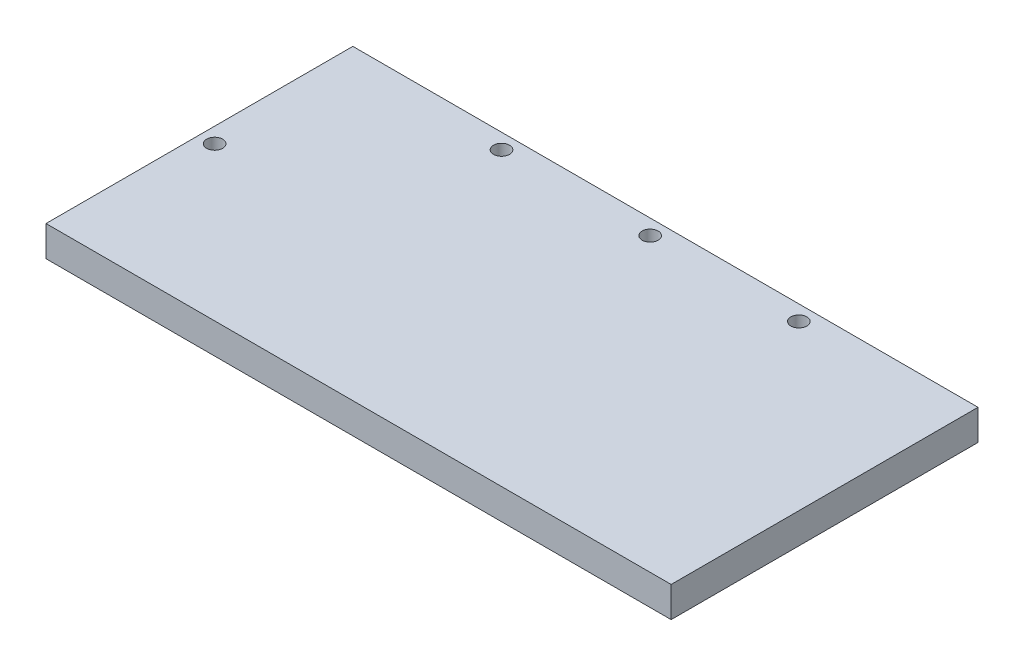
ISO-10303-21;
HEADER;
FILE_DESCRIPTION(('STEP AP214'),'2;1');
FILE_NAME('part.step','',(''),(''),'','','');
FILE_SCHEMA(('AUTOMOTIVE_DESIGN { 1 0 10303 214 1 1 1 1 }'));
ENDSEC;
DATA;
#1=APPLICATION_CONTEXT('core data for automotive mechanical design processes');
#2=APPLICATION_PROTOCOL_DEFINITION('international standard','automotive_design',2000,#1);
#3=PRODUCT_CONTEXT('',#1,'mechanical');
#4=PRODUCT('Part','Part','',(#3));
#5=PRODUCT_RELATED_PRODUCT_CATEGORY('part','',(#4));
#6=PRODUCT_DEFINITION_FORMATION('','',#4);
#7=PRODUCT_DEFINITION_CONTEXT('part definition',#1,'design');
#8=PRODUCT_DEFINITION('design','',#6,#7);
#9=PRODUCT_DEFINITION_SHAPE('','',#8);
#10=(LENGTH_UNIT() NAMED_UNIT(*) SI_UNIT(.MILLI.,.METRE.));
#11=(NAMED_UNIT(*) PLANE_ANGLE_UNIT() SI_UNIT($,.RADIAN.));
#12=(NAMED_UNIT(*) SI_UNIT($,.STERADIAN.) SOLID_ANGLE_UNIT());
#13=UNCERTAINTY_MEASURE_WITH_UNIT(LENGTH_MEASURE(1.E-05),#10,'distance_accuracy_value','');
#14=(GEOMETRIC_REPRESENTATION_CONTEXT(3) GLOBAL_UNCERTAINTY_ASSIGNED_CONTEXT((#13)) GLOBAL_UNIT_ASSIGNED_CONTEXT((#10,
#11,#12)) REPRESENTATION_CONTEXT('',''));
#15=CARTESIAN_POINT('',(0.,0.,0.));
#16=DIRECTION('',(0.,0.,1.));
#17=DIRECTION('',(1.,0.,0.));
#18=AXIS2_PLACEMENT_3D('',#15,#16,#17);
#19=CARTESIAN_POINT('',(82.,8.,0.));
#20=DIRECTION('',(1.,0.,0.));
#21=DIRECTION('',(0.,0.,-1.));
#22=AXIS2_PLACEMENT_3D('',#19,#20,#21);
#23=PLANE('',#22);
#24=DIRECTION('',(0.,0.,1.));
#25=VECTOR('',#24,1.);
#26=CARTESIAN_POINT('',(82.,0.,0.));
#27=LINE('',#26,#25);
#28=CARTESIAN_POINT('',(82.,0.,-40.25));
#29=VERTEX_POINT('',#28);
#30=CARTESIAN_POINT('',(82.,0.,40.25));
#31=VERTEX_POINT('',#30);
#32=EDGE_CURVE('E117',#29,#31,#27,.T.);
#33=ORIENTED_EDGE('',*,*,#32,.F.);
#34=DIRECTION('',(0.,-1.,0.));
#35=VECTOR('',#34,1.);
#36=CARTESIAN_POINT('',(82.,8.,-40.25));
#37=LINE('',#36,#35);
#38=CARTESIAN_POINT('',(82.,8.,-40.25));
#39=VERTEX_POINT('',#38);
#40=EDGE_CURVE('E11',#39,#29,#37,.T.);
#41=ORIENTED_EDGE('',*,*,#40,.F.);
#42=DIRECTION('',(0.,0.,1.));
#43=VECTOR('',#42,1.);
#44=CARTESIAN_POINT('',(82.,8.,0.));
#45=LINE('',#44,#43);
#46=CARTESIAN_POINT('',(82.,8.,40.25));
#47=VERTEX_POINT('',#46);
#48=EDGE_CURVE('E99',#39,#47,#45,.T.);
#49=ORIENTED_EDGE('',*,*,#48,.T.);
#50=DIRECTION('',(0.,-1.,0.));
#51=VECTOR('',#50,1.);
#52=CARTESIAN_POINT('',(82.,8.,40.25));
#53=LINE('',#52,#51);
#54=EDGE_CURVE('E79',#47,#31,#53,.T.);
#55=ORIENTED_EDGE('',*,*,#54,.T.);
#56=EDGE_LOOP('',(#33,#41,#49,#55));
#57=FACE_BOUND('',#56,.T.);
#58=ADVANCED_FACE('F41',(#57),#23,.T.);
#59=CARTESIAN_POINT('',(0.,8.,-40.25));
#60=DIRECTION('',(0.,0.,-1.));
#61=DIRECTION('',(-1.,0.,0.));
#62=AXIS2_PLACEMENT_3D('',#59,#60,#61);
#63=PLANE('',#62);
#64=DIRECTION('',(1.,0.,0.));
#65=VECTOR('',#64,1.);
#66=CARTESIAN_POINT('',(0.,0.,-40.25));
#67=LINE('',#66,#65);
#68=CARTESIAN_POINT('',(-82.,0.,-40.25));
#69=VERTEX_POINT('',#68);
#70=EDGE_CURVE('E92',#69,#29,#67,.T.);
#71=ORIENTED_EDGE('',*,*,#70,.F.);
#72=DIRECTION('',(0.,-1.,0.));
#73=VECTOR('',#72,1.);
#74=CARTESIAN_POINT('',(-82.,8.,-40.25));
#75=LINE('',#74,#73);
#76=CARTESIAN_POINT('',(-82.,8.,-40.25));
#77=VERTEX_POINT('',#76);
#78=EDGE_CURVE('E49',#77,#69,#75,.T.);
#79=ORIENTED_EDGE('',*,*,#78,.F.);
#80=DIRECTION('',(1.,0.,0.));
#81=VECTOR('',#80,1.);
#82=CARTESIAN_POINT('',(0.,8.,-40.25));
#83=LINE('',#82,#81);
#84=EDGE_CURVE('E90',#77,#39,#83,.T.);
#85=ORIENTED_EDGE('',*,*,#84,.T.);
#86=ORIENTED_EDGE('',*,*,#40,.T.);
#87=EDGE_LOOP('',(#71,#79,#85,#86));
#88=FACE_BOUND('',#87,.T.);
#89=ADVANCED_FACE('F88',(#88),#63,.T.);
#90=CARTESIAN_POINT('',(-82.,8.,0.));
#91=DIRECTION('',(1.,0.,0.));
#92=DIRECTION('',(0.,0.,-1.));
#93=AXIS2_PLACEMENT_3D('',#90,#91,#92);
#94=PLANE('',#93);
#95=DIRECTION('',(0.,0.,1.));
#96=VECTOR('',#95,1.);
#97=CARTESIAN_POINT('',(-82.,0.,0.));
#98=LINE('',#97,#96);
#99=CARTESIAN_POINT('',(-82.,0.,40.25));
#100=VERTEX_POINT('',#99);
#101=EDGE_CURVE('E72',#69,#100,#98,.T.);
#102=ORIENTED_EDGE('',*,*,#101,.T.);
#103=DIRECTION('',(0.,-1.,0.));
#104=VECTOR('',#103,1.);
#105=CARTESIAN_POINT('',(-82.,8.,40.25));
#106=LINE('',#105,#104);
#107=CARTESIAN_POINT('',(-82.,8.,40.25));
#108=VERTEX_POINT('',#107);
#109=EDGE_CURVE('E93',#108,#100,#106,.T.);
#110=ORIENTED_EDGE('',*,*,#109,.F.);
#111=DIRECTION('',(0.,0.,1.));
#112=VECTOR('',#111,1.);
#113=CARTESIAN_POINT('',(-82.,8.,0.));
#114=LINE('',#113,#112);
#115=EDGE_CURVE('E94',#77,#108,#114,.T.);
#116=ORIENTED_EDGE('',*,*,#115,.F.);
#117=ORIENTED_EDGE('',*,*,#78,.T.);
#118=EDGE_LOOP('',(#102,#110,#116,#117));
#119=FACE_BOUND('',#118,.T.);
#120=ADVANCED_FACE('F95',(#119),#94,.F.);
#121=CARTESIAN_POINT('',(39.,8.,-36.25));
#122=DIRECTION('',(0.,-1.,0.));
#123=DIRECTION('',(0.,0.,-1.));
#124=AXIS2_PLACEMENT_3D('',#121,#122,#123);
#125=CYLINDRICAL_SURFACE('',#124,2.1);
#126=CARTESIAN_POINT('',(39.,8.,-36.25));
#127=DIRECTION('',(0.,1.,0.));
#128=DIRECTION('',(0.,0.,1.));
#129=AXIS2_PLACEMENT_3D('',#126,#127,#128);
#130=CIRCLE('',#129,2.1);
#131=CARTESIAN_POINT('',(39.,8.,-34.15));
#132=VERTEX_POINT('',#131);
#133=EDGE_CURVE('E111',#132,#132,#130,.T.);
#134=ORIENTED_EDGE('',*,*,#133,.T.);
#135=EDGE_LOOP('',(#134));
#136=FACE_BOUND('',#135,.T.);
#137=CARTESIAN_POINT('',(39.,0.,-36.25));
#138=DIRECTION('',(0.,1.,0.));
#139=DIRECTION('',(0.,0.,1.));
#140=AXIS2_PLACEMENT_3D('',#137,#138,#139);
#141=CIRCLE('',#140,2.1);
#142=CARTESIAN_POINT('',(39.,0.,-34.15));
#143=VERTEX_POINT('',#142);
#144=EDGE_CURVE('E130',#143,#143,#141,.T.);
#145=ORIENTED_EDGE('',*,*,#144,.F.);
#146=EDGE_LOOP('',(#145));
#147=FACE_BOUND('',#146,.T.);
#148=ADVANCED_FACE('F149',(#136,#147),#125,.F.);
#149=CARTESIAN_POINT('',(0.,8.,-36.25));
#150=DIRECTION('',(0.,-1.,0.));
#151=DIRECTION('',(0.,0.,-1.));
#152=AXIS2_PLACEMENT_3D('',#149,#150,#151);
#153=CYLINDRICAL_SURFACE('',#152,2.1);
#154=CARTESIAN_POINT('',(0.,8.,-36.25));
#155=DIRECTION('',(0.,1.,0.));
#156=DIRECTION('',(0.,0.,1.));
#157=AXIS2_PLACEMENT_3D('',#154,#155,#156);
#158=CIRCLE('',#157,2.1);
#159=CARTESIAN_POINT('',(0.,8.,-34.15));
#160=VERTEX_POINT('',#159);
#161=EDGE_CURVE('E108',#160,#160,#158,.T.);
#162=ORIENTED_EDGE('',*,*,#161,.T.);
#163=EDGE_LOOP('',(#162));
#164=FACE_BOUND('',#163,.T.);
#165=CARTESIAN_POINT('',(0.,0.,-36.25));
#166=DIRECTION('',(0.,1.,0.));
#167=DIRECTION('',(0.,0.,1.));
#168=AXIS2_PLACEMENT_3D('',#165,#166,#167);
#169=CIRCLE('',#168,2.1);
#170=CARTESIAN_POINT('',(0.,0.,-34.15));
#171=VERTEX_POINT('',#170);
#172=EDGE_CURVE('E127',#171,#171,#169,.T.);
#173=ORIENTED_EDGE('',*,*,#172,.F.);
#174=EDGE_LOOP('',(#173));
#175=FACE_BOUND('',#174,.T.);
#176=ADVANCED_FACE('F158',(#164,#175),#153,.F.);
#177=CARTESIAN_POINT('',(-78.,8.,0.));
#178=DIRECTION('',(0.,-1.,0.));
#179=DIRECTION('',(0.,0.,-1.));
#180=AXIS2_PLACEMENT_3D('',#177,#178,#179);
#181=CYLINDRICAL_SURFACE('',#180,2.1);
#182=CARTESIAN_POINT('',(-78.,8.,0.));
#183=DIRECTION('',(0.,1.,0.));
#184=DIRECTION('',(0.,0.,1.));
#185=AXIS2_PLACEMENT_3D('',#182,#183,#184);
#186=CIRCLE('',#185,2.1);
#187=CARTESIAN_POINT('',(-78.,8.,2.1));
#188=VERTEX_POINT('',#187);
#189=EDGE_CURVE('E105',#188,#188,#186,.T.);
#190=ORIENTED_EDGE('',*,*,#189,.T.);
#191=EDGE_LOOP('',(#190));
#192=FACE_BOUND('',#191,.T.);
#193=CARTESIAN_POINT('',(-78.,0.,0.));
#194=DIRECTION('',(0.,1.,0.));
#195=DIRECTION('',(0.,0.,1.));
#196=AXIS2_PLACEMENT_3D('',#193,#194,#195);
#197=CIRCLE('',#196,2.1);
#198=CARTESIAN_POINT('',(-78.,0.,2.1));
#199=VERTEX_POINT('',#198);
#200=EDGE_CURVE('E124',#199,#199,#197,.T.);
#201=ORIENTED_EDGE('',*,*,#200,.F.);
#202=EDGE_LOOP('',(#201));
#203=FACE_BOUND('',#202,.T.);
#204=ADVANCED_FACE('F155',(#192,#203),#181,.F.);
#205=CARTESIAN_POINT('',(0.,8.,40.25));
#206=DIRECTION('',(0.,0.,-1.));
#207=DIRECTION('',(-1.,0.,0.));
#208=AXIS2_PLACEMENT_3D('',#205,#206,#207);
#209=PLANE('',#208);
#210=DIRECTION('',(1.,0.,0.));
#211=VECTOR('',#210,1.);
#212=CARTESIAN_POINT('',(0.,0.,40.25));
#213=LINE('',#212,#211);
#214=EDGE_CURVE('E122',#100,#31,#213,.T.);
#215=ORIENTED_EDGE('',*,*,#214,.T.);
#216=ORIENTED_EDGE('',*,*,#54,.F.);
#217=DIRECTION('',(1.,0.,0.));
#218=VECTOR('',#217,1.);
#219=CARTESIAN_POINT('',(0.,8.,40.25));
#220=LINE('',#219,#218);
#221=EDGE_CURVE('E57',#108,#47,#220,.T.);
#222=ORIENTED_EDGE('',*,*,#221,.F.);
#223=ORIENTED_EDGE('',*,*,#109,.T.);
#224=EDGE_LOOP('',(#215,#216,#222,#223));
#225=FACE_BOUND('',#224,.T.);
#226=ADVANCED_FACE('F138',(#225),#209,.F.);
#227=CARTESIAN_POINT('',(-39.,8.,-36.25));
#228=DIRECTION('',(0.,-1.,0.));
#229=DIRECTION('',(0.,0.,-1.));
#230=AXIS2_PLACEMENT_3D('',#227,#228,#229);
#231=CYLINDRICAL_SURFACE('',#230,2.1);
#232=CARTESIAN_POINT('',(-39.,8.,-36.25));
#233=DIRECTION('',(0.,1.,0.));
#234=DIRECTION('',(0.,0.,1.));
#235=AXIS2_PLACEMENT_3D('',#232,#233,#234);
#236=CIRCLE('',#235,2.1);
#237=CARTESIAN_POINT('',(-39.,8.,-34.15));
#238=VERTEX_POINT('',#237);
#239=EDGE_CURVE('E114',#238,#238,#236,.F.);
#240=ORIENTED_EDGE('',*,*,#239,.F.);
#241=EDGE_LOOP('',(#240));
#242=FACE_BOUND('',#241,.T.);
#243=CARTESIAN_POINT('',(-39.,0.,-36.25));
#244=DIRECTION('',(0.,1.,0.));
#245=DIRECTION('',(0.,0.,1.));
#246=AXIS2_PLACEMENT_3D('',#243,#244,#245);
#247=CIRCLE('',#246,2.1);
#248=CARTESIAN_POINT('',(-39.,0.,-34.15));
#249=VERTEX_POINT('',#248);
#250=EDGE_CURVE('E101',#249,#249,#247,.F.);
#251=ORIENTED_EDGE('',*,*,#250,.T.);
#252=EDGE_LOOP('',(#251));
#253=FACE_BOUND('',#252,.T.);
#254=ADVANCED_FACE('F154',(#242,#253),#231,.F.);
#255=CARTESIAN_POINT('',(0.,8.,0.));
#256=DIRECTION('',(0.,1.,0.));
#257=DIRECTION('',(0.,0.,1.));
#258=AXIS2_PLACEMENT_3D('',#255,#256,#257);
#259=PLANE('',#258);
#260=ORIENTED_EDGE('',*,*,#48,.F.);
#261=ORIENTED_EDGE('',*,*,#84,.F.);
#262=ORIENTED_EDGE('',*,*,#115,.T.);
#263=ORIENTED_EDGE('',*,*,#221,.T.);
#264=EDGE_LOOP('',(#260,#261,#262,#263));
#265=FACE_BOUND('',#264,.T.);
#266=ORIENTED_EDGE('',*,*,#189,.F.);
#267=EDGE_LOOP('',(#266));
#268=FACE_BOUND('',#267,.T.);
#269=ORIENTED_EDGE('',*,*,#161,.F.);
#270=EDGE_LOOP('',(#269));
#271=FACE_BOUND('',#270,.T.);
#272=ORIENTED_EDGE('',*,*,#133,.F.);
#273=EDGE_LOOP('',(#272));
#274=FACE_BOUND('',#273,.T.);
#275=ORIENTED_EDGE('',*,*,#239,.T.);
#276=EDGE_LOOP('',(#275));
#277=FACE_BOUND('',#276,.T.);
#278=ADVANCED_FACE('F97',(#265,#268,#271,#274,#277),#259,.T.);
#279=CARTESIAN_POINT('',(0.,0.,0.));
#280=DIRECTION('',(0.,1.,0.));
#281=DIRECTION('',(0.,0.,1.));
#282=AXIS2_PLACEMENT_3D('',#279,#280,#281);
#283=PLANE('',#282);
#284=ORIENTED_EDGE('',*,*,#32,.T.);
#285=ORIENTED_EDGE('',*,*,#214,.F.);
#286=ORIENTED_EDGE('',*,*,#101,.F.);
#287=ORIENTED_EDGE('',*,*,#70,.T.);
#288=EDGE_LOOP('',(#284,#285,#286,#287));
#289=FACE_BOUND('',#288,.T.);
#290=ORIENTED_EDGE('',*,*,#200,.T.);
#291=EDGE_LOOP('',(#290));
#292=FACE_BOUND('',#291,.T.);
#293=ORIENTED_EDGE('',*,*,#172,.T.);
#294=EDGE_LOOP('',(#293));
#295=FACE_BOUND('',#294,.T.);
#296=ORIENTED_EDGE('',*,*,#144,.T.);
#297=EDGE_LOOP('',(#296));
#298=FACE_BOUND('',#297,.T.);
#299=ORIENTED_EDGE('',*,*,#250,.F.);
#300=EDGE_LOOP('',(#299));
#301=FACE_BOUND('',#300,.T.);
#302=ADVANCED_FACE('F140',(#289,#292,#295,#298,#301),#283,.F.);
#303=CLOSED_SHELL('',(#58,#89,#120,#148,#176,#204,#226,#254,#278,#302));
#304=MANIFOLD_SOLID_BREP('B2',#303);
#305=ADVANCED_BREP_SHAPE_REPRESENTATION('',(#18,#304),#14);
#306=SHAPE_DEFINITION_REPRESENTATION(#9,#305);
ENDSEC;
END-ISO-10303-21;
